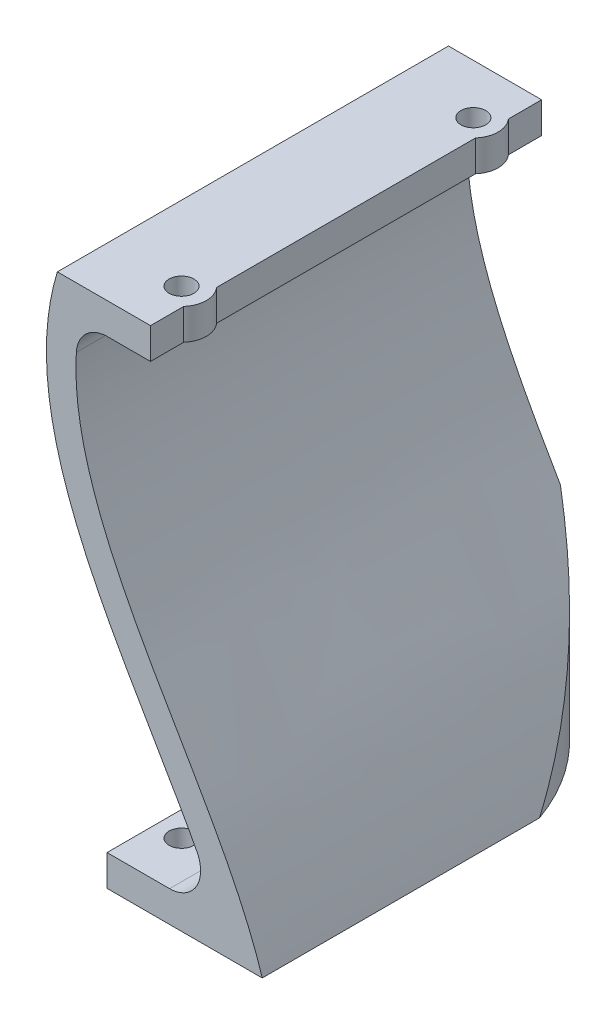
ISO-10303-21;
HEADER;
FILE_DESCRIPTION(('STEP AP214'),'2;1');
FILE_NAME('part.step','',(''),(''),'','','');
FILE_SCHEMA(('AUTOMOTIVE_DESIGN { 1 0 10303 214 1 1 1 1 }'));
ENDSEC;
DATA;
#1=APPLICATION_CONTEXT('core data for automotive mechanical design processes');
#2=APPLICATION_PROTOCOL_DEFINITION('international standard','automotive_design',2000,#1);
#3=PRODUCT_CONTEXT('',#1,'mechanical');
#4=PRODUCT('Part','Part','',(#3));
#5=PRODUCT_RELATED_PRODUCT_CATEGORY('part','',(#4));
#6=PRODUCT_DEFINITION_FORMATION('','',#4);
#7=PRODUCT_DEFINITION_CONTEXT('part definition',#1,'design');
#8=PRODUCT_DEFINITION('design','',#6,#7);
#9=PRODUCT_DEFINITION_SHAPE('','',#8);
#10=(LENGTH_UNIT() NAMED_UNIT(*) SI_UNIT(.MILLI.,.METRE.));
#11=(NAMED_UNIT(*) PLANE_ANGLE_UNIT() SI_UNIT($,.RADIAN.));
#12=(NAMED_UNIT(*) SI_UNIT($,.STERADIAN.) SOLID_ANGLE_UNIT());
#13=UNCERTAINTY_MEASURE_WITH_UNIT(LENGTH_MEASURE(1.E-05),#10,'distance_accuracy_value','');
#14=(GEOMETRIC_REPRESENTATION_CONTEXT(3) GLOBAL_UNCERTAINTY_ASSIGNED_CONTEXT((#13)) GLOBAL_UNIT_ASSIGNED_CONTEXT((#10,
#11,#12)) REPRESENTATION_CONTEXT('',''));
#15=CARTESIAN_POINT('',(0.,0.,0.));
#16=DIRECTION('',(0.,0.,1.));
#17=DIRECTION('',(1.,0.,0.));
#18=AXIS2_PLACEMENT_3D('',#15,#16,#17);
#19=CARTESIAN_POINT('',(-8.04588699669594,16.1895240178556,-63.));
#20=DIRECTION('',(1.,0.,0.));
#21=DIRECTION('',(0.,0.,1.));
#22=AXIS2_PLACEMENT_3D('',#19,#20,#21);
#23=PLANE('',#22);
#24=DIRECTION('',(0.,-1.,0.));
#25=VECTOR('',#24,1.);
#26=CARTESIAN_POINT('',(-8.04588699669594,21.1895240178556,-10.6457513110646));
#27=LINE('',#26,#25);
#28=CARTESIAN_POINT('',(-8.04588699669594,21.1895240178556,-10.6457513110646));
#29=VERTEX_POINT('',#28);
#30=CARTESIAN_POINT('',(-8.04588699669594,16.1895240178556,-10.6457513110646));
#31=VERTEX_POINT('',#30);
#32=EDGE_CURVE('E152',#29,#31,#27,.T.);
#33=ORIENTED_EDGE('',*,*,#32,.T.);
#34=DIRECTION('',(0.,0.,1.));
#35=VECTOR('',#34,1.);
#36=CARTESIAN_POINT('',(-8.04588699669594,16.1895240178556,-63.));
#37=LINE('',#36,#35);
#38=CARTESIAN_POINT('',(-8.04588699669594,16.1895240178556,-52.3542486889354));
#39=VERTEX_POINT('',#38);
#40=EDGE_CURVE('E161',#39,#31,#37,.T.);
#41=ORIENTED_EDGE('',*,*,#40,.F.);
#42=DIRECTION('',(0.,-1.,0.));
#43=VECTOR('',#42,1.);
#44=CARTESIAN_POINT('',(-8.04588699669594,21.1895240178556,-52.3542486889354));
#45=LINE('',#44,#43);
#46=CARTESIAN_POINT('',(-8.04588699669594,21.1895240178556,-52.3542486889354));
#47=VERTEX_POINT('',#46);
#48=EDGE_CURVE('E416',#39,#47,#45,.F.);
#49=ORIENTED_EDGE('',*,*,#48,.T.);
#50=DIRECTION('',(0.,0.,1.));
#51=VECTOR('',#50,1.);
#52=CARTESIAN_POINT('',(-8.04588699669594,21.1895240178556,-63.));
#53=LINE('',#52,#51);
#54=EDGE_CURVE('E172',#47,#29,#53,.T.);
#55=ORIENTED_EDGE('',*,*,#54,.T.);
#56=EDGE_LOOP('',(#33,#41,#49,#55));
#57=FACE_BOUND('',#56,.T.);
#58=ADVANCED_FACE('F35',(#57),#23,.T.);
#59=DIRECTION('',(0.,-1.,0.));
#60=VECTOR('',#59,1.);
#61=CARTESIAN_POINT('',(-8.04588699669594,21.1895240178556,-57.6457513110646));
#62=LINE('',#61,#60);
#63=CARTESIAN_POINT('',(-8.04588699669594,21.1895240178556,-57.6457513110646));
#64=VERTEX_POINT('',#63);
#65=CARTESIAN_POINT('',(-8.04588699669594,16.1895240178556,-57.6457513110646));
#66=VERTEX_POINT('',#65);
#67=EDGE_CURVE('E420',#64,#66,#62,.T.);
#68=ORIENTED_EDGE('',*,*,#67,.T.);
#69=CARTESIAN_POINT('',(-8.04588699669594,16.1895240178556,-63.));
#70=VERTEX_POINT('',#69);
#71=EDGE_CURVE('E170',#70,#66,#37,.T.);
#72=ORIENTED_EDGE('',*,*,#71,.F.);
#73=DIRECTION('',(0.,1.,0.));
#74=VECTOR('',#73,1.);
#75=CARTESIAN_POINT('',(-8.04588699669594,16.1895240178556,-63.));
#76=LINE('',#75,#74);
#77=CARTESIAN_POINT('',(-8.04588699669594,21.1895240178556,-63.));
#78=VERTEX_POINT('',#77);
#79=EDGE_CURVE('E177',#70,#78,#76,.T.);
#80=ORIENTED_EDGE('',*,*,#79,.T.);
#81=EDGE_CURVE('E168',#78,#64,#53,.T.);
#82=ORIENTED_EDGE('',*,*,#81,.T.);
#83=EDGE_LOOP('',(#68,#72,#80,#82));
#84=FACE_BOUND('',#83,.T.);
#85=ADVANCED_FACE('F241',(#84),#23,.T.);
#86=CARTESIAN_POINT('',(-22.5334776197952,22.7570781612548,-63.));
#87=CARTESIAN_POINT('',(-22.8802638174594,21.7643013859488,-63.));
#88=CARTESIAN_POINT('',(-23.5022218297949,19.7353540922829,-63.));
#89=CARTESIAN_POINT('',(-24.3984566732412,15.7227335791878,-63.));
#90=CARTESIAN_POINT('',(-24.9259424602794,10.7154717202631,-63.));
#91=CARTESIAN_POINT('',(-24.7059244457818,4.80639957244901,-63.));
#92=CARTESIAN_POINT('',(-23.4437954980132,-2.90791828688786,-63.));
#93=CARTESIAN_POINT('',(-20.3649701079,-12.2138739410152,-63.));
#94=CARTESIAN_POINT('',(-15.1627192062184,-22.9267758821705,-63.));
#95=CARTESIAN_POINT('',(-9.22446854976525,-33.2839412268649,-63.));
#96=CARTESIAN_POINT('',(-4.2731817504284,-41.6523064711653,-63.));
#97=CARTESIAN_POINT('',(-0.670405229165687,-48.1782991582584,-63.));
#98=CARTESIAN_POINT('',(1.76514247549924,-52.980809675903,-63.));
#99=CARTESIAN_POINT('',(3.49961876568494,-56.8892897902748,-63.));
#100=CARTESIAN_POINT('',(4.67496429136453,-59.9655632013083,-63.));
#101=CARTESIAN_POINT('',(5.17847746688474,-61.4613851443489,-63.));
#102=CARTESIAN_POINT('',(5.41540171981831,-62.2227851308582,-63.));
#103=B_SPLINE_CURVE_WITH_KNOTS('',3,(#86,#87,#88,#89,#90,#91,#92,#93,#94,#95,#96,#97,#98,#99,
#100,#101,#102),.UNSPECIFIED.,.F.,.F.,(4,1,1,1,1,1,1,1,1,1,1,1,1,1,4),(0.,0.03125,0.0625,0.125,
0.1875,0.25,0.375,0.5,0.625,0.75,0.8125,0.875,0.9375,0.96875,1.),.UNSPECIFIED.);
#104=DIRECTION('',(0.,0.,1.));
#105=VECTOR('',#104,1.);
#106=SURFACE_OF_LINEAR_EXTRUSION('',#103,#105);
#107=CARTESIAN_POINT('',(-22.5334776197952,22.7570781612548,0.));
#108=CARTESIAN_POINT('',(-22.8802638174594,21.7643013859488,0.));
#109=CARTESIAN_POINT('',(-23.5022218297949,19.7353540922829,0.));
#110=CARTESIAN_POINT('',(-24.3984566732412,15.7227335791878,0.));
#111=CARTESIAN_POINT('',(-24.9259424602794,10.7154717202631,0.));
#112=CARTESIAN_POINT('',(-24.7059244457818,4.80639957244901,0.));
#113=CARTESIAN_POINT('',(-23.4437954980132,-2.90791828688786,0.));
#114=CARTESIAN_POINT('',(-20.3649701079,-12.2138739410152,0.));
#115=CARTESIAN_POINT('',(-15.1627192062184,-22.9267758821705,0.));
#116=CARTESIAN_POINT('',(-9.22446854976525,-33.2839412268649,0.));
#117=CARTESIAN_POINT('',(-4.2731817504284,-41.6523064711653,0.));
#118=CARTESIAN_POINT('',(-0.670405229165687,-48.1782991582584,0.));
#119=CARTESIAN_POINT('',(1.76514247549924,-52.980809675903,0.));
#120=CARTESIAN_POINT('',(3.49961876568494,-56.8892897902748,0.));
#121=CARTESIAN_POINT('',(4.67496429136453,-59.9655632013083,0.));
#122=CARTESIAN_POINT('',(5.17847746688474,-61.4613851443489,0.));
#123=CARTESIAN_POINT('',(5.41540171981831,-62.2227851308582,0.));
#124=B_SPLINE_CURVE_WITH_KNOTS('',3,(#107,#108,#109,#110,#111,#112,#113,#114,#115,#116,#117,
#118,#119,#120,#121,#122,#123),.UNSPECIFIED.,.F.,.F.,(4,1,1,1,1,1,1,1,1,1,1,1,1,1,4),(0.,
0.03125,0.0625,0.125,0.1875,0.25,0.375,0.5,0.625,0.75,0.8125,0.875,0.9375,0.96875,1.),.UNSPECIFIED.);
#125=CARTESIAN_POINT('',(-23.0458869966959,21.1895240178556,0.));
#126=VERTEX_POINT('',#125);
#127=CARTESIAN_POINT('',(-0.547367076397604,-48.4799277852592,0.));
#128=VERTEX_POINT('',#127);
#129=EDGE_CURVE('E439',#126,#128,#124,.T.);
#130=ORIENTED_EDGE('',*,*,#129,.F.);
#131=DIRECTION('',(0.,0.,1.));
#132=VECTOR('',#131,1.);
#133=CARTESIAN_POINT('',(-23.0458869966959,21.1895240178556,-63.));
#134=LINE('',#133,#132);
#135=CARTESIAN_POINT('',(-23.0458869966959,21.1895240178556,-63.));
#136=VERTEX_POINT('',#135);
#137=EDGE_CURVE('E323',#136,#126,#134,.T.);
#138=ORIENTED_EDGE('',*,*,#137,.F.);
#139=CARTESIAN_POINT('',(-5.01813061937269,-40.4452947344386,-63.));
#140=VERTEX_POINT('',#139);
#141=EDGE_CURVE('E246',#136,#140,#103,.T.);
#142=ORIENTED_EDGE('',*,*,#141,.T.);
#143=CARTESIAN_POINT('',(4.95411300330391,-60.8104759821441,-54.0000000000008));
#144=CARTESIAN_POINT('',(4.90349240523971,-60.6624313935854,-54.0674948355469));
#145=CARTESIAN_POINT('',(4.85228015714574,-60.5147179013902,-54.1352686678515));
#146=CARTESIAN_POINT('',(4.74872079575584,-60.2199020777657,-54.2712735017647));
#147=CARTESIAN_POINT('',(4.69637369264215,-60.0727997408671,-54.3395044992676));
#148=CARTESIAN_POINT('',(4.53770600661707,-59.6323418051575,-54.5447278378918));
#149=CARTESIAN_POINT('',(4.42975460412531,-59.3398223214441,-54.6822564553985));
#150=CARTESIAN_POINT('',(4.2099997972146,-58.7573547873543,-54.9578604064212));
#151=CARTESIAN_POINT('',(4.09820516931407,-58.4674025618739,-55.0959339299031));
#152=CARTESIAN_POINT('',(3.87072927247109,-57.8892159839013,-55.372479618315));
#153=CARTESIAN_POINT('',(3.75504796123735,-57.6009816501418,-55.5109517875676));
#154=CARTESIAN_POINT('',(3.40277730186655,-56.7393967928728,-55.9259585911872));
#155=CARTESIAN_POINT('',(3.16063667503191,-56.1683081741342,-56.2024916641073));
#156=CARTESIAN_POINT('',(2.66323588313109,-55.0311603375767,-56.752440378181));
#157=CARTESIAN_POINT('',(2.40798853220512,-54.4650968189405,-57.0258587564976));
#158=CARTESIAN_POINT('',(1.88556069418228,-53.3365016649056,-57.567548245747));
#159=CARTESIAN_POINT('',(1.61838726458699,-52.7739681595952,-57.8358222700236));
#160=CARTESIAN_POINT('',(1.073194276384,-51.6511984601395,-58.3656141915534));
#161=CARTESIAN_POINT('',(0.79517759037044,-51.0909617004231,-58.6271338480642));
#162=CARTESIAN_POINT('',(0.229354253579259,-49.971891846354,-59.1421014589343));
#163=CARTESIAN_POINT('',(-0.0584503905774647,-49.4130584892179,-59.3955510473469));
#164=CARTESIAN_POINT('',(-0.643021472242761,-48.2958111208271,-59.8934766461389));
#165=CARTESIAN_POINT('',(-0.939790828653196,-47.7373973081717,-60.1379496750854));
#166=CARTESIAN_POINT('',(-1.54143204723711,-46.620198752619,-60.6171398718671));
#167=CARTESIAN_POINT('',(-1.84630918952724,-46.0614140111213,-60.8518504136079));
#168=CARTESIAN_POINT('',(-2.46331872475682,-44.9427496650343,-61.3108798373551));
#169=CARTESIAN_POINT('',(-2.77545814129195,-44.3828695246849,-61.5351879732312));
#170=CARTESIAN_POINT('',(-3.40618824346694,-43.2613700453329,-61.9729133196452));
#171=CARTESIAN_POINT('',(-3.72478710707736,-42.6997493772916,-62.1863153414548));
#172=CARTESIAN_POINT('',(-4.36760769727572,-41.5741550070399,-62.6018397814107));
#173=CARTESIAN_POINT('',(-4.6918380749877,-41.0101789264886,-62.803942373091));
#174=CARTESIAN_POINT('',(-5.01813061937269,-40.4452947255246,-63.));
#175=B_SPLINE_CURVE_WITH_KNOTS('',3,(#143,#144,#145,#146,#147,#148,#149,#150,#151,#152,#153,
#154,#155,#156,#157,#158,#159,#160,#161,#162,#163,#164,#165,#166,#167,#168,#169,#170,#171,#172,
#173,#174),.UNSPECIFIED.,.F.,.F.,(4,2,2,2,2,2,2,2,2,2,2,2,2,2,2,4),(0.,0.51118765682345,
1.0223707290117,2.04469209211411,3.0648164806874,4.08495197290759,6.12221617166067,
8.15752516266589,10.1916452842124,12.2252301392514,14.2584005745832,16.2922402994086,
18.3274386472271,20.3646946291989,22.4047145812519,24.4482084138024),.UNSPECIFIED.);
#176=CARTESIAN_POINT('',(-0.547367076397604,-48.4799277852592,-59.8107553305762));
#177=VERTEX_POINT('',#176);
#178=EDGE_CURVE('E213',#177,#140,#175,.T.);
#179=ORIENTED_EDGE('',*,*,#178,.F.);
#180=DIRECTION('',(0.,0.,1.));
#181=VECTOR('',#180,1.);
#182=CARTESIAN_POINT('',(-0.547367076397604,-48.4799277852592,0.));
#183=LINE('',#182,#181);
#184=EDGE_CURVE('E307',#128,#177,#183,.F.);
#185=ORIENTED_EDGE('',*,*,#184,.F.);
#186=EDGE_LOOP('',(#130,#138,#142,#179,#185));
#187=FACE_BOUND('',#186,.T.);
#188=ADVANCED_FACE('F234',(#187),#106,.T.);
#189=CARTESIAN_POINT('',(9.95411300330407,-60.8104759821444,-63.));
#190=CARTESIAN_POINT('',(1.78782004145555,-34.5665002552168,-63.));
#191=CARTESIAN_POINT('',(-27.9913048539535,-7.28206006884536,-63.));
#192=CARTESIAN_POINT('',(-18.0458869966959,21.1895240178556,-63.));
#193=B_SPLINE_CURVE_WITH_KNOTS('',3,(#189,#190,#191,#192),.UNSPECIFIED.,.F.,.F.,(4,4),(0.,1.),.UNSPECIFIED.);
#194=DIRECTION('',(0.,0.,1.));
#195=VECTOR('',#194,1.);
#196=SURFACE_OF_LINEAR_EXTRUSION('',#193,#195);
#197=CARTESIAN_POINT('',(9.95411300330407,-60.8104759821444,0.));
#198=CARTESIAN_POINT('',(1.78782004145555,-34.5665002552168,0.));
#199=CARTESIAN_POINT('',(-27.9913048539535,-7.28206006884536,0.));
#200=CARTESIAN_POINT('',(-18.0458869966959,21.1895240178556,0.));
#201=B_SPLINE_CURVE_WITH_KNOTS('',3,(#197,#198,#199,#200),.UNSPECIFIED.,.F.,.F.,(4,4),(0.,1.),.UNSPECIFIED.);
#202=CARTESIAN_POINT('',(9.95411300330406,-60.8104759821444,0.));
#203=VERTEX_POINT('',#202);
#204=CARTESIAN_POINT('',(-19.9900394366485,11.486126685123,0.));
#205=VERTEX_POINT('',#204);
#206=EDGE_CURVE('E268',#203,#205,#201,.T.);
#207=ORIENTED_EDGE('',*,*,#206,.F.);
#208=DIRECTION('',(0.,0.,1.));
#209=VECTOR('',#208,1.);
#210=CARTESIAN_POINT('',(9.95411300330406,-60.8104759821444,-63.));
#211=LINE('',#210,#209);
#212=CARTESIAN_POINT('',(9.95411300330406,-60.8104759821444,-44.6619037896883));
#213=VERTEX_POINT('',#212);
#214=EDGE_CURVE('E253',#213,#203,#211,.T.);
#215=ORIENTED_EDGE('',*,*,#214,.F.);
#216=CARTESIAN_POINT('',(-5.0181306193727,-31.0078311625575,-63.));
#217=CARTESIAN_POINT('',(-4.60935478871972,-31.7093489817674,-62.7543834576857));
#218=CARTESIAN_POINT('',(-4.20131738668795,-32.4074621662793,-62.4977858251789));
#219=CARTESIAN_POINT('',(-3.38815053326057,-33.7979902999724,-61.9622212423446));
#220=CARTESIAN_POINT('',(-2.98302506777499,-34.4903975790361,-61.6832283301339));
#221=CARTESIAN_POINT('',(-2.17774614790639,-35.8695543054951,-61.1027999865766));
#222=CARTESIAN_POINT('',(-1.77759715288152,-36.5562985153545,-60.8013459119863));
#223=CARTESIAN_POINT('',(-0.984236379295756,-37.9241689025045,-60.176069993751));
#224=CARTESIAN_POINT('',(-0.591028520440266,-38.6052917966567,-59.8522359892382));
#225=CARTESIAN_POINT('',(0.186556274459307,-39.9619679869169,-59.1823796789401));
#226=CARTESIAN_POINT('',(0.570930531293133,-40.6375195544411,-58.8363507590432));
#227=CARTESIAN_POINT('',(1.3290305770706,-41.9831065709882,-58.1223910025535));
#228=CARTESIAN_POINT('',(1.70275537964647,-42.6531415049921,-57.7544581468735));
#229=CARTESIAN_POINT('',(2.43012663076156,-43.9738009345563,-57.0049927504614));
#230=CARTESIAN_POINT('',(2.78402981414216,-44.6245377583915,-56.6239074134592));
#231=CARTESIAN_POINT('',(3.47834929596888,-45.9207760458694,-55.841592183967));
#232=CARTESIAN_POINT('',(3.8187694469618,-46.5662789624713,-55.4403681211582));
#233=CARTESIAN_POINT('',(4.48461305361077,-47.8521060489027,-54.6183080963177));
#234=CARTESIAN_POINT('',(4.81004218024758,-48.4924321002493,-54.1974796736569));
#235=CARTESIAN_POINT('',(5.44446074986746,-49.7679759540932,-53.3368082931973));
#236=CARTESIAN_POINT('',(5.75345713100086,-50.4031958147794,-52.8969735046521));
#237=CARTESIAN_POINT('',(6.35362692502806,-51.668602208051,-51.998950726406));
#238=CARTESIAN_POINT('',(6.64480781639683,-52.2987907547047,-51.5407705731015));
#239=CARTESIAN_POINT('',(7.20802833998733,-53.5542360752454,-50.6067565075788));
#240=CARTESIAN_POINT('',(7.48007509549706,-54.1794946066895,-50.1309292668871));
#241=CARTESIAN_POINT('',(7.88360437077701,-55.1393628105839,-49.3846055812668));
#242=CARTESIAN_POINT('',(8.02228760728581,-55.4756419508452,-49.1201168128509));
#243=CARTESIAN_POINT('',(8.29348824945376,-56.1468062732093,-48.5863134766866));
#244=CARTESIAN_POINT('',(8.42600620315316,-56.4816915767931,-48.3169993408307));
#245=CARTESIAN_POINT('',(8.68468158126303,-57.1500766823737,-47.7736773751326));
#246=CARTESIAN_POINT('',(8.81083932781482,-57.4835765537551,-47.4996697839553));
#247=CARTESIAN_POINT('',(9.05731909261769,-58.1511351652741,-46.9454888321691));
#248=CARTESIAN_POINT('',(9.17760304580604,-58.4851859397498,-46.6652889384022));
#249=CARTESIAN_POINT('',(9.41135731410957,-59.1519111697765,-46.1004093247949));
#250=CARTESIAN_POINT('',(9.52482730060768,-59.4845855582292,-45.8157293897299));
#251=CARTESIAN_POINT('',(9.7447698306712,-60.1485677299589,-45.2420271879806));
#252=CARTESIAN_POINT('',(9.85124160344067,-60.4798753589445,-44.9530044472646));
#253=CARTESIAN_POINT('',(9.95411300330407,-60.8104759821444,-44.6619037896883));
#254=B_SPLINE_CURVE_WITH_KNOTS('',3,(#216,#217,#218,#219,#220,#221,#222,#223,#224,#225,#226,
#227,#228,#229,#230,#231,#232,#233,#234,#235,#236,#237,#238,#239,#240,#241,#242,#243,#244,#245,
#246,#247,#248,#249,#250,#251,#252,#253),.UNSPECIFIED.,.F.,.F.,(4,2,2,2,2,2,2,2,2,2,2,2,2,2,2,2,
2,2,4),(0.,2.5447278282158,5.09244947623089,7.64230986377158,10.1935668641723,12.7455877066058,
15.2978441576055,17.796560169186,20.2945569873373,22.7916009405601,25.2875820950726,
27.7825082102457,30.276500539272,31.625677636978,32.9747345744782,34.3237231141295,
35.6805309618773,37.0374041919111,38.394426620853),.UNSPECIFIED.);
#255=CARTESIAN_POINT('',(-5.01813061937411,-31.0078311625551,-63.));
#256=VERTEX_POINT('',#255);
#257=EDGE_CURVE('E222',#256,#213,#254,.T.);
#258=ORIENTED_EDGE('',*,*,#257,.F.);
#259=CARTESIAN_POINT('',(-19.9900394366485,11.486126685123,-63.));
#260=VERTEX_POINT('',#259);
#261=EDGE_CURVE('E301',#256,#260,#193,.T.);
#262=ORIENTED_EDGE('',*,*,#261,.T.);
#263=DIRECTION('',(0.,0.,1.));
#264=VECTOR('',#263,1.);
#265=CARTESIAN_POINT('',(-19.9900394366485,11.486126685123,0.));
#266=LINE('',#265,#264);
#267=EDGE_CURVE('E280',#205,#260,#266,.F.);
#268=ORIENTED_EDGE('',*,*,#267,.F.);
#269=EDGE_LOOP('',(#207,#215,#258,#262,#268));
#270=FACE_BOUND('',#269,.T.);
#271=ADVANCED_FACE('F240',(#270),#196,.T.);
#272=CARTESIAN_POINT('',(-18.0458869966959,21.1895240178556,-63.));
#273=DIRECTION('',(0.,-1.,0.));
#274=DIRECTION('',(0.,0.,1.));
#275=AXIS2_PLACEMENT_3D('',#272,#273,#274);
#276=PLANE('',#275);
#277=ORIENTED_EDGE('',*,*,#54,.F.);
#278=CARTESIAN_POINT('',(-11.0458869966959,21.1895240178556,-55.));
#279=DIRECTION('',(0.,1.,0.));
#280=DIRECTION('',(1.,0.,0.));
#281=AXIS2_PLACEMENT_3D('',#278,#279,#280);
#282=CIRCLE('',#281,4.);
#283=EDGE_CURVE('E414',#47,#64,#282,.T.);
#284=ORIENTED_EDGE('',*,*,#283,.T.);
#285=ORIENTED_EDGE('',*,*,#81,.F.);
#286=DIRECTION('',(-1.,0.,0.));
#287=VECTOR('',#286,1.);
#288=CARTESIAN_POINT('',(-18.0458869966959,21.1895240178556,-63.));
#289=LINE('',#288,#287);
#290=EDGE_CURVE('E254',#78,#136,#289,.T.);
#291=ORIENTED_EDGE('',*,*,#290,.T.);
#292=ORIENTED_EDGE('',*,*,#137,.T.);
#293=DIRECTION('',(-1.,0.,0.));
#294=VECTOR('',#293,1.);
#295=CARTESIAN_POINT('',(-18.0458869966959,21.1895240178556,0.));
#296=LINE('',#295,#294);
#297=CARTESIAN_POINT('',(-8.04588699669594,21.1895240178556,0.));
#298=VERTEX_POINT('',#297);
#299=EDGE_CURVE('E262',#298,#126,#296,.T.);
#300=ORIENTED_EDGE('',*,*,#299,.F.);
#301=CARTESIAN_POINT('',(-8.04588699669594,21.1895240178556,-5.35424868893539));
#302=VERTEX_POINT('',#301);
#303=EDGE_CURVE('E174',#302,#298,#53,.T.);
#304=ORIENTED_EDGE('',*,*,#303,.F.);
#305=CARTESIAN_POINT('',(-11.0458869966959,21.1895240178556,-8.));
#306=DIRECTION('',(0.,1.,0.));
#307=DIRECTION('',(1.,0.,0.));
#308=AXIS2_PLACEMENT_3D('',#305,#306,#307);
#309=CIRCLE('',#308,4.);
#310=EDGE_CURVE('E57',#302,#29,#309,.T.);
#311=ORIENTED_EDGE('',*,*,#310,.T.);
#312=EDGE_LOOP('',(#277,#284,#285,#291,#292,#300,#304,#311));
#313=FACE_BOUND('',#312,.T.);
#314=CARTESIAN_POINT('',(-11.0458869966959,21.1895240178556,-55.));
#315=DIRECTION('',(0.,1.,0.));
#316=DIRECTION('',(0.,0.,1.));
#317=AXIS2_PLACEMENT_3D('',#314,#315,#316);
#318=CIRCLE('',#317,2.);
#319=CARTESIAN_POINT('',(-11.0458869966959,21.1895240178556,-53.));
#320=VERTEX_POINT('',#319);
#321=EDGE_CURVE('E426',#320,#320,#318,.T.);
#322=ORIENTED_EDGE('',*,*,#321,.F.);
#323=EDGE_LOOP('',(#322));
#324=FACE_BOUND('',#323,.T.);
#325=CARTESIAN_POINT('',(-11.0458869966959,21.1895240178556,-8.));
#326=DIRECTION('',(0.,1.,0.));
#327=DIRECTION('',(0.,0.,1.));
#328=AXIS2_PLACEMENT_3D('',#325,#326,#327);
#329=CIRCLE('',#328,2.);
#330=CARTESIAN_POINT('',(-11.0458869966959,21.1895240178556,-6.));
#331=VERTEX_POINT('',#330);
#332=EDGE_CURVE('E430',#331,#331,#329,.T.);
#333=ORIENTED_EDGE('',*,*,#332,.F.);
#334=EDGE_LOOP('',(#333));
#335=FACE_BOUND('',#334,.T.);
#336=ADVANCED_FACE('F245',(#313,#324,#335),#276,.F.);
#337=CARTESIAN_POINT('',(9.95411300330406,-60.8104759821444,-63.));
#338=DIRECTION('',(0.,1.,0.));
#339=DIRECTION('',(0.,0.,-1.));
#340=AXIS2_PLACEMENT_3D('',#337,#338,#339);
#341=PLANE('',#340);
#342=CARTESIAN_POINT('',(-11.0458869966959,-60.8104759821444,-55.));
#343=DIRECTION('',(0.,-1.,0.));
#344=DIRECTION('',(0.,0.,-1.));
#345=AXIS2_PLACEMENT_3D('',#342,#343,#344);
#346=CIRCLE('',#345,2.);
#347=CARTESIAN_POINT('',(-11.0458869966959,-60.8104759821444,-57.));
#348=VERTEX_POINT('',#347);
#349=EDGE_CURVE('E163',#348,#348,#346,.T.);
#350=ORIENTED_EDGE('',*,*,#349,.F.);
#351=EDGE_LOOP('',(#350));
#352=FACE_BOUND('',#351,.T.);
#353=CARTESIAN_POINT('',(-11.0458869966959,-60.8104759821444,-8.));
#354=DIRECTION('',(0.,-1.,0.));
#355=DIRECTION('',(0.,0.,-1.));
#356=AXIS2_PLACEMENT_3D('',#353,#354,#355);
#357=CIRCLE('',#356,2.);
#358=CARTESIAN_POINT('',(-11.0458869966959,-60.8104759821444,-10.));
#359=VERTEX_POINT('',#358);
#360=EDGE_CURVE('E402',#359,#359,#357,.T.);
#361=ORIENTED_EDGE('',*,*,#360,.F.);
#362=EDGE_LOOP('',(#361));
#363=FACE_BOUND('',#362,.T.);
#364=ORIENTED_EDGE('',*,*,#214,.T.);
#365=DIRECTION('',(1.,0.,0.));
#366=VECTOR('',#365,1.);
#367=CARTESIAN_POINT('',(9.95411300330406,-60.8104759821444,0.));
#368=LINE('',#367,#366);
#369=CARTESIAN_POINT('',(-15.0458869966959,-60.8104759821444,0.));
#370=VERTEX_POINT('',#369);
#371=EDGE_CURVE('E327',#370,#203,#368,.T.);
#372=ORIENTED_EDGE('',*,*,#371,.F.);
#373=DIRECTION('',(0.,0.,1.));
#374=VECTOR('',#373,1.);
#375=CARTESIAN_POINT('',(-15.0458869966959,-60.8104759821444,0.));
#376=LINE('',#375,#374);
#377=CARTESIAN_POINT('',(-15.0458869966959,-60.8104759821444,-63.));
#378=VERTEX_POINT('',#377);
#379=EDGE_CURVE('E193',#378,#370,#376,.T.);
#380=ORIENTED_EDGE('',*,*,#379,.F.);
#381=DIRECTION('',(-1.,0.,0.));
#382=VECTOR('',#381,1.);
#383=CARTESIAN_POINT('',(-5.01813061937269,-60.8104759821444,-63.));
#384=LINE('',#383,#382);
#385=CARTESIAN_POINT('',(-5.01813061937269,-60.8104759821444,-63.));
#386=VERTEX_POINT('',#385);
#387=EDGE_CURVE('E202',#386,#378,#384,.T.);
#388=ORIENTED_EDGE('',*,*,#387,.F.);
#389=CARTESIAN_POINT('',(-23.0458869966979,-60.8104759821444,-33.0000000000031));
#390=DIRECTION('',(0.,-1.,0.));
#391=DIRECTION('',(0.,0.,1.));
#392=AXIS2_PLACEMENT_3D('',#389,#390,#391);
#393=CIRCLE('',#392,35.);
#394=EDGE_CURVE('E209',#386,#213,#393,.T.);
#395=ORIENTED_EDGE('',*,*,#394,.T.);
#396=EDGE_LOOP('',(#364,#372,#380,#388,#395));
#397=FACE_BOUND('',#396,.T.);
#398=ADVANCED_FACE('F243',(#352,#363,#397),#341,.F.);
#399=CARTESIAN_POINT('',(-10.8377785538607,-20.6458291170594,-63.));
#400=DIRECTION('',(0.,0.,1.));
#401=DIRECTION('',(-1.,0.,0.));
#402=AXIS2_PLACEMENT_3D('',#399,#400,#401);
#403=PLANE('',#402);
#404=ORIENTED_EDGE('',*,*,#141,.F.);
#405=ORIENTED_EDGE('',*,*,#290,.F.);
#406=ORIENTED_EDGE('',*,*,#79,.F.);
#407=DIRECTION('',(1.,0.,0.));
#408=VECTOR('',#407,1.);
#409=CARTESIAN_POINT('',(-18.0458869966959,16.1895240178556,-63.));
#410=LINE('',#409,#408);
#411=CARTESIAN_POINT('',(-14.9988445037922,16.1895240178556,-63.));
#412=VERTEX_POINT('',#411);
#413=EDGE_CURVE('E184',#412,#70,#410,.T.);
#414=ORIENTED_EDGE('',*,*,#413,.F.);
#415=CARTESIAN_POINT('',(-14.9988445037922,11.1895240178556,-63.));
#416=DIRECTION('',(0.,0.,-1.));
#417=DIRECTION('',(-1.,0.,0.));
#418=AXIS2_PLACEMENT_3D('',#415,#416,#417);
#419=CIRCLE('',#418,5.);
#420=EDGE_CURVE('E43',#260,#412,#419,.T.);
#421=ORIENTED_EDGE('',*,*,#420,.F.);
#422=ORIENTED_EDGE('',*,*,#261,.F.);
#423=DIRECTION('',(0.,-1.,0.));
#424=VECTOR('',#423,1.);
#425=CARTESIAN_POINT('',(-5.0181306193727,-0.81047598214444,-63.));
#426=LINE('',#425,#424);
#427=EDGE_CURVE('E314',#140,#256,#426,.F.);
#428=ORIENTED_EDGE('',*,*,#427,.F.);
#429=EDGE_LOOP('',(#404,#405,#406,#414,#421,#422,#428));
#430=FACE_BOUND('',#429,.T.);
#431=ADVANCED_FACE('F293',(#430),#403,.F.);
#432=CARTESIAN_POINT('',(-10.8377785538607,-20.6458291170594,0.));
#433=DIRECTION('',(0.,0.,1.));
#434=DIRECTION('',(-1.,0.,0.));
#435=AXIS2_PLACEMENT_3D('',#432,#433,#434);
#436=PLANE('',#435);
#437=ORIENTED_EDGE('',*,*,#371,.T.);
#438=ORIENTED_EDGE('',*,*,#206,.T.);
#439=CARTESIAN_POINT('',(-14.9988445037922,11.1895240178556,0.));
#440=DIRECTION('',(0.,0.,-1.));
#441=DIRECTION('',(-1.,0.,0.));
#442=AXIS2_PLACEMENT_3D('',#439,#440,#441);
#443=CIRCLE('',#442,5.);
#444=CARTESIAN_POINT('',(-14.9988445037922,16.1895240178556,0.));
#445=VERTEX_POINT('',#444);
#446=EDGE_CURVE('E11',#445,#205,#443,.F.);
#447=ORIENTED_EDGE('',*,*,#446,.F.);
#448=DIRECTION('',(1.,0.,0.));
#449=VECTOR('',#448,1.);
#450=CARTESIAN_POINT('',(-18.0458869966959,16.1895240178556,0.));
#451=LINE('',#450,#449);
#452=CARTESIAN_POINT('',(-8.04588699669594,16.1895240178556,0.));
#453=VERTEX_POINT('',#452);
#454=EDGE_CURVE('E188',#445,#453,#451,.T.);
#455=ORIENTED_EDGE('',*,*,#454,.T.);
#456=DIRECTION('',(0.,1.,0.));
#457=VECTOR('',#456,1.);
#458=CARTESIAN_POINT('',(-8.04588699669594,16.1895240178556,0.));
#459=LINE('',#458,#457);
#460=EDGE_CURVE('E166',#453,#298,#459,.T.);
#461=ORIENTED_EDGE('',*,*,#460,.T.);
#462=ORIENTED_EDGE('',*,*,#299,.T.);
#463=ORIENTED_EDGE('',*,*,#129,.T.);
#464=CARTESIAN_POINT('',(-4.97100190558444,-50.8104759821445,0.));
#465=DIRECTION('',(0.,0.,-1.));
#466=DIRECTION('',(-1.,0.,0.));
#467=AXIS2_PLACEMENT_3D('',#464,#465,#466);
#468=CIRCLE('',#467,5.);
#469=CARTESIAN_POINT('',(-4.97100190558444,-55.8104759821444,0.));
#470=VERTEX_POINT('',#469);
#471=EDGE_CURVE('E303',#470,#128,#468,.F.);
#472=ORIENTED_EDGE('',*,*,#471,.F.);
#473=DIRECTION('',(1.,0.,0.));
#474=VECTOR('',#473,1.);
#475=CARTESIAN_POINT('',(-15.0458869966959,-55.8104759821444,0.));
#476=LINE('',#475,#474);
#477=CARTESIAN_POINT('',(-15.0458869966959,-55.8104759821444,0.));
#478=VERTEX_POINT('',#477);
#479=EDGE_CURVE('E198',#478,#470,#476,.T.);
#480=ORIENTED_EDGE('',*,*,#479,.F.);
#481=DIRECTION('',(0.,-1.,0.));
#482=VECTOR('',#481,1.);
#483=CARTESIAN_POINT('',(-15.0458869966959,-55.8104759821444,0.));
#484=LINE('',#483,#482);
#485=EDGE_CURVE('E207',#478,#370,#484,.T.);
#486=ORIENTED_EDGE('',*,*,#485,.T.);
#487=EDGE_LOOP('',(#437,#438,#447,#455,#461,#462,#463,#472,#480,#486));
#488=FACE_BOUND('',#487,.T.);
#489=ADVANCED_FACE('F296',(#488),#436,.T.);
#490=CARTESIAN_POINT('',(-23.0458869966979,-0.81047598214444,-33.0000000000031));
#491=DIRECTION('',(0.,-1.,0.));
#492=DIRECTION('',(0.,0.,1.));
#493=AXIS2_PLACEMENT_3D('',#490,#491,#492);
#494=CYLINDRICAL_SURFACE('',#493,35.);
#495=ORIENTED_EDGE('',*,*,#178,.T.);
#496=ORIENTED_EDGE('',*,*,#427,.T.);
#497=ORIENTED_EDGE('',*,*,#257,.T.);
#498=ORIENTED_EDGE('',*,*,#394,.F.);
#499=DIRECTION('',(0.,-1.,0.));
#500=VECTOR('',#499,1.);
#501=CARTESIAN_POINT('',(-5.01813061937269,-55.8104759821444,-63.));
#502=LINE('',#501,#500);
#503=CARTESIAN_POINT('',(-5.01813061937269,-55.8104759821444,-63.));
#504=VERTEX_POINT('',#503);
#505=EDGE_CURVE('E201',#504,#386,#502,.T.);
#506=ORIENTED_EDGE('',*,*,#505,.F.);
#507=CARTESIAN_POINT('',(-23.0458869966979,-55.8104759821444,-33.0000000000031));
#508=DIRECTION('',(0.,1.,0.));
#509=DIRECTION('',(0.,0.,1.));
#510=AXIS2_PLACEMENT_3D('',#507,#508,#509);
#511=CIRCLE('',#510,35.);
#512=CARTESIAN_POINT('',(-4.97100190558443,-55.8104759821444,-62.9716287335746));
#513=VERTEX_POINT('',#512);
#514=EDGE_CURVE('E189',#513,#504,#511,.T.);
#515=ORIENTED_EDGE('',*,*,#514,.F.);
#516=CARTESIAN_POINT('',(-0.547367076397604,-48.4799277852592,-59.8107553305762));
#517=CARTESIAN_POINT('',(-0.497352203450341,-48.5748468475239,-59.7687849611889));
#518=CARTESIAN_POINT('',(-0.450019764998988,-48.6721128439989,-59.7288266569617));
#519=CARTESIAN_POINT('',(-0.361168492256912,-48.8710692269845,-59.6534602501073));
#520=CARTESIAN_POINT('',(-0.319654517811251,-48.9727632201404,-59.6180559531997));
#521=CARTESIAN_POINT('',(-0.242818447225023,-49.1805668908898,-59.5522623449912));
#522=CARTESIAN_POINT('',(-0.207522084906531,-49.2866927706424,-59.5218939054326));
#523=CARTESIAN_POINT('',(-0.14382381436109,-49.5024257205868,-59.4669090416992));
#524=CARTESIAN_POINT('',(-0.115420130789087,-49.6120318861198,-59.4422911364225));
#525=CARTESIAN_POINT('',(-0.0658086346219534,-49.8346912834593,-59.3991872392885));
#526=CARTESIAN_POINT('',(-0.0446400195729425,-49.9477597854684,-59.3807346611385));
#527=CARTESIAN_POINT('',(-0.0100835349486135,-50.1759650327343,-59.3505652176071));
#528=CARTESIAN_POINT('',(0.00330495077993898,-50.2911016134632,-59.3388478188289));
#529=CARTESIAN_POINT('',(0.0220263081494884,-50.5222417277358,-59.3224529924965));
#530=CARTESIAN_POINT('',(0.0273790214721301,-50.6382424127962,-59.3177582249814));
#531=CARTESIAN_POINT('',(0.0299864462437955,-50.8703973771393,-59.3154720293513));
#532=CARTESIAN_POINT('',(0.0272417972542282,-50.9865516435673,-59.3178800402309));
#533=CARTESIAN_POINT('',(0.014212274575819,-51.2094162834473,-59.3292971767019));
#534=CARTESIAN_POINT('',(0.00450321260185671,-51.3161866951164,-59.3378021772774));
#535=CARTESIAN_POINT('',(-0.0216385549246912,-51.5282790162719,-59.3606576974807));
#536=CARTESIAN_POINT('',(-0.0380734494454068,-51.6336004426306,-59.3750101201851));
#537=CARTESIAN_POINT('',(-0.0971422077593378,-51.9464481650583,-59.4264624477316));
#538=CARTESIAN_POINT('',(-0.14954077910925,-52.1508681925408,-59.4719579771349));
#539=CARTESIAN_POINT('',(-0.279391107321395,-52.5525353358603,-59.5837189177769));
#540=CARTESIAN_POINT('',(-0.357542116475636,-52.7493878720789,-59.6505622103834));
#541=CARTESIAN_POINT('',(-0.53490076550024,-53.1266136831699,-59.8005413058401));
#542=CARTESIAN_POINT('',(-0.634117139343329,-53.3069800781656,-59.8836838654777));
#543=CARTESIAN_POINT('',(-0.901248947470861,-53.7303818198436,-60.104561923925));
#544=CARTESIAN_POINT('',(-1.07954931100205,-53.963086436961,-60.2496026421771));
#545=CARTESIAN_POINT('',(-1.46653422765664,-54.3884200521527,-60.5570834783933));
#546=CARTESIAN_POINT('',(-1.67527583877909,-54.5809721055028,-60.7195561155713));
#547=CARTESIAN_POINT('',(-2.12012880916492,-54.927903181211,-61.0569367494142));
#548=CARTESIAN_POINT('',(-2.35660260492555,-55.0816686616995,-61.2319943104723));
#549=CARTESIAN_POINT('',(-2.84899729626945,-55.3464666206391,-61.586319357166));
#550=CARTESIAN_POINT('',(-3.10490289376471,-55.4575323061428,-61.7655834558403));
#551=CARTESIAN_POINT('',(-3.62427851514264,-55.6332581712266,-62.1186665332604));
#552=CARTESIAN_POINT('',(-3.88731818345797,-55.6991631406167,-62.2924935897343));
#553=CARTESIAN_POINT('',(-4.28905794886377,-55.7656153777095,-62.5500728983311));
#554=CARTESIAN_POINT('',(-4.42421349722153,-55.782365426749,-62.6354333114313));
#555=CARTESIAN_POINT('',(-4.69636862489995,-55.8047927567,-62.8047128158873));
#556=CARTESIAN_POINT('',(-4.83336856804437,-55.8104678197646,-62.8886316152151));
#557=CARTESIAN_POINT('',(-4.97100190558442,-55.8104759821445,-62.9716287335746));
#558=B_SPLINE_CURVE_WITH_KNOTS('',3,(#516,#517,#518,#519,#520,#521,#522,#523,#524,#525,#526,
#527,#528,#529,#530,#531,#532,#533,#534,#535,#536,#537,#538,#539,#540,#541,#542,#543,#544,#545,
#546,#547,#548,#549,#550,#551,#552,#553,#554,#555,#556,#557),.UNSPECIFIED.,.F.,.F.,(4,2,2,2,2,2,
2,2,2,2,2,2,2,2,2,2,2,2,2,2,4),(0.,0.345602334729504,0.691491633555237,1.03878050083468,
1.38597982186137,1.7350314115602,2.0840553540853,2.43221607178991,2.78034929113282,
3.1025977631233,3.4249511965914,4.06962747740181,4.73349157817641,5.39763146498129,
6.37355759369337,7.35133705244375,8.3437302896735,9.33535018737793,10.2984006856782,
10.7802426315688,11.2621810599296),.UNSPECIFIED.);
#559=EDGE_CURVE('E272',#177,#513,#558,.T.);
#560=ORIENTED_EDGE('',*,*,#559,.F.);
#561=EDGE_LOOP('',(#495,#496,#497,#498,#506,#515,#560));
#562=FACE_BOUND('',#561,.T.);
#563=ADVANCED_FACE('F230',(#562),#494,.T.);
#564=CARTESIAN_POINT('',(-23.0458869966979,-55.8104759821444,-33.0000000000031));
#565=DIRECTION('',(0.,-1.,0.));
#566=DIRECTION('',(0.,0.,1.));
#567=AXIS2_PLACEMENT_3D('',#564,#565,#566);
#568=PLANE('',#567);
#569=CARTESIAN_POINT('',(-11.0458869966959,-55.8104759821444,-55.));
#570=DIRECTION('',(0.,-1.,0.));
#571=DIRECTION('',(0.,0.,-1.));
#572=AXIS2_PLACEMENT_3D('',#569,#570,#571);
#573=CIRCLE('',#572,2.);
#574=CARTESIAN_POINT('',(-11.0458869966959,-55.8104759821444,-57.));
#575=VERTEX_POINT('',#574);
#576=EDGE_CURVE('E400',#575,#575,#573,.T.);
#577=ORIENTED_EDGE('',*,*,#576,.T.);
#578=EDGE_LOOP('',(#577));
#579=FACE_BOUND('',#578,.T.);
#580=CARTESIAN_POINT('',(-11.0458869966959,-55.8104759821444,-8.));
#581=DIRECTION('',(0.,-1.,0.));
#582=DIRECTION('',(0.,0.,-1.));
#583=AXIS2_PLACEMENT_3D('',#580,#581,#582);
#584=CIRCLE('',#583,2.);
#585=CARTESIAN_POINT('',(-11.0458869966959,-55.8104759821444,-10.));
#586=VERTEX_POINT('',#585);
#587=EDGE_CURVE('E406',#586,#586,#584,.T.);
#588=ORIENTED_EDGE('',*,*,#587,.T.);
#589=EDGE_LOOP('',(#588));
#590=FACE_BOUND('',#589,.T.);
#591=ORIENTED_EDGE('',*,*,#514,.T.);
#592=DIRECTION('',(-1.,0.,0.));
#593=VECTOR('',#592,1.);
#594=CARTESIAN_POINT('',(-5.01813061937269,-55.8104759821444,-63.));
#595=LINE('',#594,#593);
#596=CARTESIAN_POINT('',(-15.0458869966959,-55.8104759821444,-63.));
#597=VERTEX_POINT('',#596);
#598=EDGE_CURVE('E192',#504,#597,#595,.T.);
#599=ORIENTED_EDGE('',*,*,#598,.T.);
#600=DIRECTION('',(0.,0.,1.));
#601=VECTOR('',#600,1.);
#602=CARTESIAN_POINT('',(-15.0458869966959,-55.8104759821444,0.));
#603=LINE('',#602,#601);
#604=EDGE_CURVE('E196',#597,#478,#603,.T.);
#605=ORIENTED_EDGE('',*,*,#604,.T.);
#606=ORIENTED_EDGE('',*,*,#479,.T.);
#607=DIRECTION('',(0.,0.,-1.));
#608=VECTOR('',#607,1.);
#609=CARTESIAN_POINT('',(-4.97100190558444,-55.8104759821444,0.));
#610=LINE('',#609,#608);
#611=EDGE_CURVE('E310',#513,#470,#610,.F.);
#612=ORIENTED_EDGE('',*,*,#611,.F.);
#613=EDGE_LOOP('',(#591,#599,#605,#606,#612));
#614=FACE_BOUND('',#613,.T.);
#615=ADVANCED_FACE('F344',(#579,#590,#614),#568,.F.);
#616=CARTESIAN_POINT('',(-15.0458869966959,-55.8104759821444,0.));
#617=DIRECTION('',(-1.,0.,0.));
#618=DIRECTION('',(0.,0.,-1.));
#619=AXIS2_PLACEMENT_3D('',#616,#617,#618);
#620=PLANE('',#619);
#621=ORIENTED_EDGE('',*,*,#379,.T.);
#622=ORIENTED_EDGE('',*,*,#485,.F.);
#623=ORIENTED_EDGE('',*,*,#604,.F.);
#624=DIRECTION('',(0.,-1.,0.));
#625=VECTOR('',#624,1.);
#626=CARTESIAN_POINT('',(-15.0458869966959,-55.8104759821444,-63.));
#627=LINE('',#626,#625);
#628=EDGE_CURVE('E210',#597,#378,#627,.T.);
#629=ORIENTED_EDGE('',*,*,#628,.T.);
#630=EDGE_LOOP('',(#621,#622,#623,#629));
#631=FACE_BOUND('',#630,.T.);
#632=ADVANCED_FACE('F353',(#631),#620,.T.);
#633=CARTESIAN_POINT('',(-5.01813061937269,-55.8104759821444,-63.));
#634=DIRECTION('',(0.,0.,-1.));
#635=DIRECTION('',(1.,0.,0.));
#636=AXIS2_PLACEMENT_3D('',#633,#634,#635);
#637=PLANE('',#636);
#638=ORIENTED_EDGE('',*,*,#387,.T.);
#639=ORIENTED_EDGE('',*,*,#628,.F.);
#640=ORIENTED_EDGE('',*,*,#598,.F.);
#641=ORIENTED_EDGE('',*,*,#505,.T.);
#642=EDGE_LOOP('',(#638,#639,#640,#641));
#643=FACE_BOUND('',#642,.T.);
#644=ADVANCED_FACE('F341',(#643),#637,.T.);
#645=CARTESIAN_POINT('',(-4.97100190558444,-50.8104759821445,-28.1877687802507));
#646=DIRECTION('',(0.,0.,1.));
#647=DIRECTION('',(-1.,0.,0.));
#648=AXIS2_PLACEMENT_3D('',#645,#646,#647);
#649=CYLINDRICAL_SURFACE('',#648,5.);
#650=ORIENTED_EDGE('',*,*,#559,.T.);
#651=ORIENTED_EDGE('',*,*,#611,.T.);
#652=ORIENTED_EDGE('',*,*,#471,.T.);
#653=ORIENTED_EDGE('',*,*,#184,.T.);
#654=EDGE_LOOP('',(#650,#651,#652,#653));
#655=FACE_BOUND('',#654,.T.);
#656=ADVANCED_FACE('F346',(#655),#649,.F.);
#657=CARTESIAN_POINT('',(-18.0458869966959,16.1895240178556,5.17978739319327));
#658=DIRECTION('',(0.,-1.,0.));
#659=DIRECTION('',(1.,0.,0.));
#660=AXIS2_PLACEMENT_3D('',#657,#658,#659);
#661=PLANE('',#660);
#662=CARTESIAN_POINT('',(-8.04588699669594,16.1895240178556,-5.35424868893541));
#663=VERTEX_POINT('',#662);
#664=EDGE_CURVE('E158',#663,#453,#37,.T.);
#665=ORIENTED_EDGE('',*,*,#664,.T.);
#666=ORIENTED_EDGE('',*,*,#454,.F.);
#667=DIRECTION('',(0.,0.,1.));
#668=VECTOR('',#667,1.);
#669=CARTESIAN_POINT('',(-14.9988445037922,16.1895240178556,5.17978739319327));
#670=LINE('',#669,#668);
#671=EDGE_CURVE('E283',#412,#445,#670,.T.);
#672=ORIENTED_EDGE('',*,*,#671,.F.);
#673=ORIENTED_EDGE('',*,*,#413,.T.);
#674=ORIENTED_EDGE('',*,*,#71,.T.);
#675=CARTESIAN_POINT('',(-11.0458869966959,16.1895240178556,-55.));
#676=DIRECTION('',(0.,1.,0.));
#677=DIRECTION('',(1.,0.,0.));
#678=AXIS2_PLACEMENT_3D('',#675,#676,#677);
#679=CIRCLE('',#678,4.);
#680=EDGE_CURVE('E413',#39,#66,#679,.T.);
#681=ORIENTED_EDGE('',*,*,#680,.F.);
#682=ORIENTED_EDGE('',*,*,#40,.T.);
#683=CARTESIAN_POINT('',(-11.0458869966959,16.1895240178556,-8.));
#684=DIRECTION('',(0.,1.,0.));
#685=DIRECTION('',(1.,0.,0.));
#686=AXIS2_PLACEMENT_3D('',#683,#684,#685);
#687=CIRCLE('',#686,4.);
#688=EDGE_CURVE('E150',#663,#31,#687,.T.);
#689=ORIENTED_EDGE('',*,*,#688,.F.);
#690=EDGE_LOOP('',(#665,#666,#672,#673,#674,#681,#682,#689));
#691=FACE_BOUND('',#690,.T.);
#692=CARTESIAN_POINT('',(-11.0458869966959,16.1895240178556,-8.));
#693=DIRECTION('',(0.,1.,0.));
#694=DIRECTION('',(1.,0.,0.));
#695=AXIS2_PLACEMENT_3D('',#692,#693,#694);
#696=CIRCLE('',#695,2.);
#697=CARTESIAN_POINT('',(-9.04588699669594,16.1895240178556,-8.));
#698=VERTEX_POINT('',#697);
#699=EDGE_CURVE('E423',#698,#698,#696,.T.);
#700=ORIENTED_EDGE('',*,*,#699,.T.);
#701=EDGE_LOOP('',(#700));
#702=FACE_BOUND('',#701,.T.);
#703=CARTESIAN_POINT('',(-11.0458869966959,16.1895240178556,-55.));
#704=DIRECTION('',(0.,1.,0.));
#705=DIRECTION('',(1.,0.,0.));
#706=AXIS2_PLACEMENT_3D('',#703,#704,#705);
#707=CIRCLE('',#706,2.);
#708=CARTESIAN_POINT('',(-9.04588699669594,16.1895240178556,-55.));
#709=VERTEX_POINT('',#708);
#710=EDGE_CURVE('E422',#709,#709,#707,.T.);
#711=ORIENTED_EDGE('',*,*,#710,.T.);
#712=EDGE_LOOP('',(#711));
#713=FACE_BOUND('',#712,.T.);
#714=ADVANCED_FACE('F155',(#691,#702,#713),#661,.T.);
#715=DIRECTION('',(0.,-1.,0.));
#716=VECTOR('',#715,1.);
#717=CARTESIAN_POINT('',(-8.04588699669594,21.1895240178556,-5.35424868893539));
#718=LINE('',#717,#716);
#719=EDGE_CURVE('E50',#663,#302,#718,.F.);
#720=ORIENTED_EDGE('',*,*,#719,.T.);
#721=ORIENTED_EDGE('',*,*,#303,.T.);
#722=ORIENTED_EDGE('',*,*,#460,.F.);
#723=ORIENTED_EDGE('',*,*,#664,.F.);
#724=EDGE_LOOP('',(#720,#721,#722,#723));
#725=FACE_BOUND('',#724,.T.);
#726=ADVANCED_FACE('F165',(#725),#23,.T.);
#727=CARTESIAN_POINT('',(-14.9988445037922,11.1895240178556,-31.5));
#728=DIRECTION('',(0.,0.,1.));
#729=DIRECTION('',(-1.,0.,0.));
#730=AXIS2_PLACEMENT_3D('',#727,#728,#729);
#731=CYLINDRICAL_SURFACE('',#730,5.);
#732=ORIENTED_EDGE('',*,*,#446,.T.);
#733=ORIENTED_EDGE('',*,*,#267,.T.);
#734=ORIENTED_EDGE('',*,*,#420,.T.);
#735=ORIENTED_EDGE('',*,*,#671,.T.);
#736=EDGE_LOOP('',(#732,#733,#734,#735));
#737=FACE_BOUND('',#736,.T.);
#738=ADVANCED_FACE('F37',(#737),#731,.F.);
#739=CARTESIAN_POINT('',(-11.0458869966959,26.1895240178556,-55.));
#740=DIRECTION('',(0.,-1.,0.));
#741=DIRECTION('',(1.,0.,0.));
#742=AXIS2_PLACEMENT_3D('',#739,#740,#741);
#743=CYLINDRICAL_SURFACE('',#742,2.);
#744=ORIENTED_EDGE('',*,*,#710,.F.);
#745=EDGE_LOOP('',(#744));
#746=FACE_BOUND('',#745,.T.);
#747=ORIENTED_EDGE('',*,*,#321,.T.);
#748=EDGE_LOOP('',(#747));
#749=FACE_BOUND('',#748,.T.);
#750=ADVANCED_FACE('F366',(#746,#749),#743,.F.);
#751=CARTESIAN_POINT('',(-11.0458869966959,26.1895240178556,-8.));
#752=DIRECTION('',(0.,-1.,0.));
#753=DIRECTION('',(1.,0.,0.));
#754=AXIS2_PLACEMENT_3D('',#751,#752,#753);
#755=CYLINDRICAL_SURFACE('',#754,2.);
#756=ORIENTED_EDGE('',*,*,#699,.F.);
#757=EDGE_LOOP('',(#756));
#758=FACE_BOUND('',#757,.T.);
#759=ORIENTED_EDGE('',*,*,#332,.T.);
#760=EDGE_LOOP('',(#759));
#761=FACE_BOUND('',#760,.T.);
#762=ADVANCED_FACE('F370',(#758,#761),#755,.F.);
#763=CARTESIAN_POINT('',(-11.0458869966959,21.1895240178556,-55.));
#764=DIRECTION('',(0.,-1.,0.));
#765=DIRECTION('',(1.,0.,0.));
#766=AXIS2_PLACEMENT_3D('',#763,#764,#765);
#767=CYLINDRICAL_SURFACE('',#766,4.);
#768=ORIENTED_EDGE('',*,*,#283,.F.);
#769=ORIENTED_EDGE('',*,*,#48,.F.);
#770=ORIENTED_EDGE('',*,*,#680,.T.);
#771=ORIENTED_EDGE('',*,*,#67,.F.);
#772=EDGE_LOOP('',(#768,#769,#770,#771));
#773=FACE_BOUND('',#772,.T.);
#774=ADVANCED_FACE('F375',(#773),#767,.T.);
#775=CARTESIAN_POINT('',(-11.0458869966959,21.1895240178556,-8.));
#776=DIRECTION('',(0.,-1.,0.));
#777=DIRECTION('',(1.,0.,0.));
#778=AXIS2_PLACEMENT_3D('',#775,#776,#777);
#779=CYLINDRICAL_SURFACE('',#778,4.);
#780=ORIENTED_EDGE('',*,*,#310,.F.);
#781=ORIENTED_EDGE('',*,*,#719,.F.);
#782=ORIENTED_EDGE('',*,*,#688,.T.);
#783=ORIENTED_EDGE('',*,*,#32,.F.);
#784=EDGE_LOOP('',(#780,#781,#782,#783));
#785=FACE_BOUND('',#784,.T.);
#786=ADVANCED_FACE('F148',(#785),#779,.T.);
#787=CARTESIAN_POINT('',(-11.0458869966959,-60.8104759821444,-8.));
#788=DIRECTION('',(0.,1.,0.));
#789=DIRECTION('',(0.,0.,-1.));
#790=AXIS2_PLACEMENT_3D('',#787,#788,#789);
#791=CYLINDRICAL_SURFACE('',#790,2.);
#792=ORIENTED_EDGE('',*,*,#360,.T.);
#793=EDGE_LOOP('',(#792));
#794=FACE_BOUND('',#793,.T.);
#795=ORIENTED_EDGE('',*,*,#587,.F.);
#796=EDGE_LOOP('',(#795));
#797=FACE_BOUND('',#796,.T.);
#798=ADVANCED_FACE('F386',(#794,#797),#791,.F.);
#799=CARTESIAN_POINT('',(-11.0458869966959,-60.8104759821444,-55.));
#800=DIRECTION('',(0.,1.,0.));
#801=DIRECTION('',(0.,0.,-1.));
#802=AXIS2_PLACEMENT_3D('',#799,#800,#801);
#803=CYLINDRICAL_SURFACE('',#802,2.);
#804=ORIENTED_EDGE('',*,*,#349,.T.);
#805=EDGE_LOOP('',(#804));
#806=FACE_BOUND('',#805,.T.);
#807=ORIENTED_EDGE('',*,*,#576,.F.);
#808=EDGE_LOOP('',(#807));
#809=FACE_BOUND('',#808,.T.);
#810=ADVANCED_FACE('F389',(#806,#809),#803,.F.);
#811=CLOSED_SHELL('',(#58,#85,#188,#271,#336,#398,#431,#489,#563,#615,#632,#644,#656,#714,#726,
#738,#750,#762,#774,#786,#798,#810));
#812=MANIFOLD_SOLID_BREP('B2',#811);
#813=ADVANCED_BREP_SHAPE_REPRESENTATION('',(#18,#812),#14);
#814=SHAPE_DEFINITION_REPRESENTATION(#9,#813);
ENDSEC;
END-ISO-10303-21;
